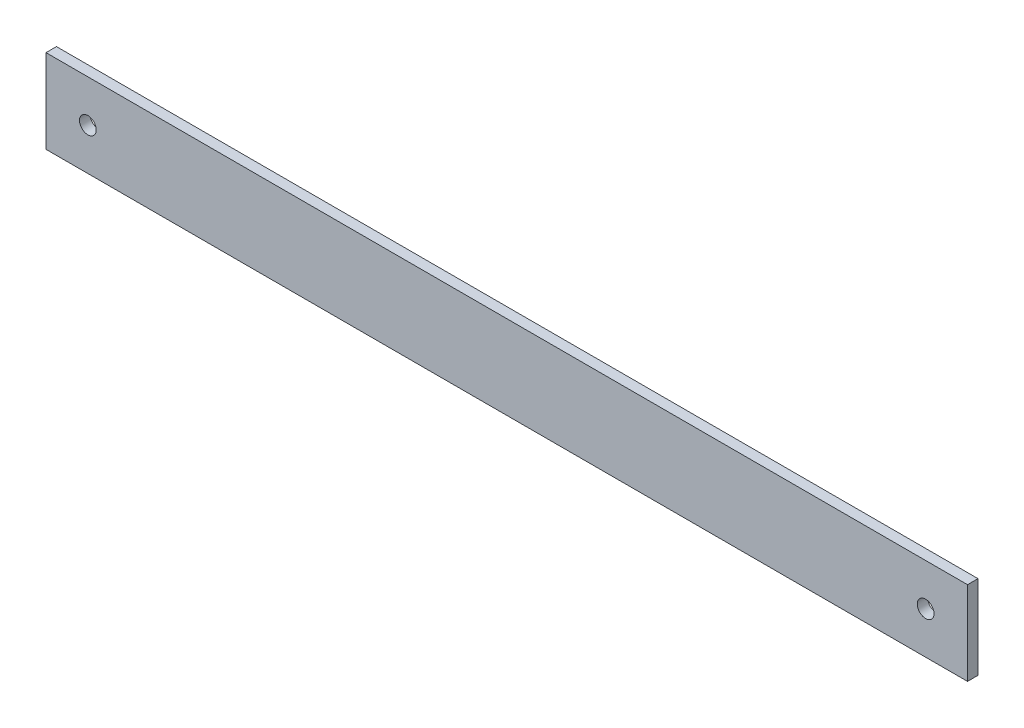
ISO-10303-21;
HEADER;
FILE_DESCRIPTION(('STEP AP214'),'2;1');
FILE_NAME('part.step','',(''),(''),'','','');
FILE_SCHEMA(('AUTOMOTIVE_DESIGN { 1 0 10303 214 1 1 1 1 }'));
ENDSEC;
DATA;
#1=APPLICATION_CONTEXT('core data for automotive mechanical design processes');
#2=APPLICATION_PROTOCOL_DEFINITION('international standard','automotive_design',2000,#1);
#3=PRODUCT_CONTEXT('',#1,'mechanical');
#4=PRODUCT('Part','Part','',(#3));
#5=PRODUCT_RELATED_PRODUCT_CATEGORY('part','',(#4));
#6=PRODUCT_DEFINITION_FORMATION('','',#4);
#7=PRODUCT_DEFINITION_CONTEXT('part definition',#1,'design');
#8=PRODUCT_DEFINITION('design','',#6,#7);
#9=PRODUCT_DEFINITION_SHAPE('','',#8);
#10=(LENGTH_UNIT() NAMED_UNIT(*) SI_UNIT(.MILLI.,.METRE.));
#11=(NAMED_UNIT(*) PLANE_ANGLE_UNIT() SI_UNIT($,.RADIAN.));
#12=(NAMED_UNIT(*) SI_UNIT($,.STERADIAN.) SOLID_ANGLE_UNIT());
#13=UNCERTAINTY_MEASURE_WITH_UNIT(LENGTH_MEASURE(1.E-05),#10,'distance_accuracy_value','');
#14=(GEOMETRIC_REPRESENTATION_CONTEXT(3) GLOBAL_UNCERTAINTY_ASSIGNED_CONTEXT((#13)) GLOBAL_UNIT_ASSIGNED_CONTEXT((#10,
#11,#12)) REPRESENTATION_CONTEXT('',''));
#15=CARTESIAN_POINT('',(0.,0.,0.));
#16=DIRECTION('',(0.,0.,1.));
#17=DIRECTION('',(1.,0.,0.));
#18=AXIS2_PLACEMENT_3D('',#15,#16,#17);
#19=CARTESIAN_POINT('',(0.,0.,5.));
#20=DIRECTION('',(0.,0.,1.));
#21=DIRECTION('',(1.,0.,0.));
#22=AXIS2_PLACEMENT_3D('',#19,#20,#21);
#23=PLANE('',#22);
#24=CARTESIAN_POINT('',(200.,0.,5.));
#25=DIRECTION('',(0.,0.,1.));
#26=DIRECTION('',(1.,0.,0.));
#27=AXIS2_PLACEMENT_3D('',#24,#25,#26);
#28=CIRCLE('',#27,3.99999999999999);
#29=CARTESIAN_POINT('',(204.,0.,5.));
#30=VERTEX_POINT('',#29);
#31=EDGE_CURVE('E100',#30,#30,#28,.T.);
#32=ORIENTED_EDGE('',*,*,#31,.F.);
#33=EDGE_LOOP('',(#32));
#34=FACE_BOUND('',#33,.T.);
#35=DIRECTION('',(0.,1.,0.));
#36=VECTOR('',#35,1.);
#37=CARTESIAN_POINT('',(220.,20.,5.));
#38=LINE('',#37,#36);
#39=CARTESIAN_POINT('',(220.,-20.,5.));
#40=VERTEX_POINT('',#39);
#41=CARTESIAN_POINT('',(220.,20.,5.));
#42=VERTEX_POINT('',#41);
#43=EDGE_CURVE('E85',#40,#42,#38,.T.);
#44=ORIENTED_EDGE('',*,*,#43,.T.);
#45=DIRECTION('',(-1.,0.,0.));
#46=VECTOR('',#45,1.);
#47=CARTESIAN_POINT('',(-220.,20.,5.));
#48=LINE('',#47,#46);
#49=CARTESIAN_POINT('',(-220.,20.,5.));
#50=VERTEX_POINT('',#49);
#51=EDGE_CURVE('E80',#42,#50,#48,.T.);
#52=ORIENTED_EDGE('',*,*,#51,.T.);
#53=DIRECTION('',(0.,-1.,0.));
#54=VECTOR('',#53,1.);
#55=CARTESIAN_POINT('',(-220.,20.,5.));
#56=LINE('',#55,#54);
#57=CARTESIAN_POINT('',(-220.,-20.,5.));
#58=VERTEX_POINT('',#57);
#59=EDGE_CURVE('E83',#50,#58,#56,.T.);
#60=ORIENTED_EDGE('',*,*,#59,.T.);
#61=DIRECTION('',(1.,0.,0.));
#62=VECTOR('',#61,1.);
#63=CARTESIAN_POINT('',(-220.,-20.,5.));
#64=LINE('',#63,#62);
#65=EDGE_CURVE('E50',#58,#40,#64,.T.);
#66=ORIENTED_EDGE('',*,*,#65,.T.);
#67=EDGE_LOOP('',(#44,#52,#60,#66));
#68=FACE_BOUND('',#67,.T.);
#69=CARTESIAN_POINT('',(-200.,0.,5.));
#70=DIRECTION('',(0.,0.,1.));
#71=DIRECTION('',(-1.,0.,0.));
#72=AXIS2_PLACEMENT_3D('',#69,#70,#71);
#73=CIRCLE('',#72,3.99999999999999);
#74=CARTESIAN_POINT('',(-204.,0.,5.));
#75=VERTEX_POINT('',#74);
#76=EDGE_CURVE('E115',#75,#75,#73,.T.);
#77=ORIENTED_EDGE('',*,*,#76,.F.);
#78=EDGE_LOOP('',(#77));
#79=FACE_BOUND('',#78,.T.);
#80=ADVANCED_FACE('F33',(#34,#68,#79),#23,.T.);
#81=CARTESIAN_POINT('',(0.,0.,0.));
#82=DIRECTION('',(0.,0.,1.));
#83=DIRECTION('',(1.,0.,0.));
#84=AXIS2_PLACEMENT_3D('',#81,#82,#83);
#85=PLANE('',#84);
#86=CARTESIAN_POINT('',(200.,0.,0.));
#87=DIRECTION('',(0.,0.,1.));
#88=DIRECTION('',(1.,0.,0.));
#89=AXIS2_PLACEMENT_3D('',#86,#87,#88);
#90=CIRCLE('',#89,3.99999999999999);
#91=CARTESIAN_POINT('',(204.,0.,0.));
#92=VERTEX_POINT('',#91);
#93=EDGE_CURVE('E112',#92,#92,#90,.T.);
#94=ORIENTED_EDGE('',*,*,#93,.T.);
#95=EDGE_LOOP('',(#94));
#96=FACE_BOUND('',#95,.T.);
#97=DIRECTION('',(0.,1.,0.));
#98=VECTOR('',#97,1.);
#99=CARTESIAN_POINT('',(220.,20.,0.));
#100=LINE('',#99,#98);
#101=CARTESIAN_POINT('',(220.,-20.,0.));
#102=VERTEX_POINT('',#101);
#103=CARTESIAN_POINT('',(220.,20.,0.));
#104=VERTEX_POINT('',#103);
#105=EDGE_CURVE('E97',#102,#104,#100,.T.);
#106=ORIENTED_EDGE('',*,*,#105,.F.);
#107=DIRECTION('',(1.,0.,0.));
#108=VECTOR('',#107,1.);
#109=CARTESIAN_POINT('',(-220.,-20.,0.));
#110=LINE('',#109,#108);
#111=CARTESIAN_POINT('',(-220.,-20.,0.));
#112=VERTEX_POINT('',#111);
#113=EDGE_CURVE('E73',#112,#102,#110,.T.);
#114=ORIENTED_EDGE('',*,*,#113,.F.);
#115=DIRECTION('',(0.,-1.,0.));
#116=VECTOR('',#115,1.);
#117=CARTESIAN_POINT('',(-220.,20.,0.));
#118=LINE('',#117,#116);
#119=CARTESIAN_POINT('',(-220.,20.,0.));
#120=VERTEX_POINT('',#119);
#121=EDGE_CURVE('E67',#120,#112,#118,.T.);
#122=ORIENTED_EDGE('',*,*,#121,.F.);
#123=DIRECTION('',(-1.,0.,0.));
#124=VECTOR('',#123,1.);
#125=CARTESIAN_POINT('',(-220.,20.,0.));
#126=LINE('',#125,#124);
#127=EDGE_CURVE('E89',#104,#120,#126,.T.);
#128=ORIENTED_EDGE('',*,*,#127,.F.);
#129=EDGE_LOOP('',(#106,#114,#122,#128));
#130=FACE_BOUND('',#129,.T.);
#131=CARTESIAN_POINT('',(-200.,0.,0.));
#132=DIRECTION('',(0.,0.,1.));
#133=DIRECTION('',(-1.,0.,0.));
#134=AXIS2_PLACEMENT_3D('',#131,#132,#133);
#135=CIRCLE('',#134,3.99999999999999);
#136=CARTESIAN_POINT('',(-204.,0.,0.));
#137=VERTEX_POINT('',#136);
#138=EDGE_CURVE('E118',#137,#137,#135,.T.);
#139=ORIENTED_EDGE('',*,*,#138,.T.);
#140=EDGE_LOOP('',(#139));
#141=FACE_BOUND('',#140,.T.);
#142=ADVANCED_FACE('F108',(#96,#130,#141),#85,.F.);
#143=CARTESIAN_POINT('',(220.,20.,5.));
#144=DIRECTION('',(-1.,0.,0.));
#145=DIRECTION('',(0.,-1.,0.));
#146=AXIS2_PLACEMENT_3D('',#143,#144,#145);
#147=PLANE('',#146);
#148=ORIENTED_EDGE('',*,*,#105,.T.);
#149=DIRECTION('',(0.,0.,-1.));
#150=VECTOR('',#149,1.);
#151=CARTESIAN_POINT('',(220.,20.,5.));
#152=LINE('',#151,#150);
#153=EDGE_CURVE('E11',#42,#104,#152,.T.);
#154=ORIENTED_EDGE('',*,*,#153,.F.);
#155=ORIENTED_EDGE('',*,*,#43,.F.);
#156=DIRECTION('',(0.,0.,-1.));
#157=VECTOR('',#156,1.);
#158=CARTESIAN_POINT('',(220.,-20.,5.));
#159=LINE('',#158,#157);
#160=EDGE_CURVE('E93',#40,#102,#159,.T.);
#161=ORIENTED_EDGE('',*,*,#160,.T.);
#162=EDGE_LOOP('',(#148,#154,#155,#161));
#163=FACE_BOUND('',#162,.T.);
#164=ADVANCED_FACE('F35',(#163),#147,.F.);
#165=CARTESIAN_POINT('',(-220.,20.,5.));
#166=DIRECTION('',(0.,-1.,0.));
#167=DIRECTION('',(1.,0.,0.));
#168=AXIS2_PLACEMENT_3D('',#165,#166,#167);
#169=PLANE('',#168);
#170=ORIENTED_EDGE('',*,*,#127,.T.);
#171=DIRECTION('',(0.,0.,-1.));
#172=VECTOR('',#171,1.);
#173=CARTESIAN_POINT('',(-220.,20.,5.));
#174=LINE('',#173,#172);
#175=EDGE_CURVE('E42',#50,#120,#174,.T.);
#176=ORIENTED_EDGE('',*,*,#175,.F.);
#177=ORIENTED_EDGE('',*,*,#51,.F.);
#178=ORIENTED_EDGE('',*,*,#153,.T.);
#179=EDGE_LOOP('',(#170,#176,#177,#178));
#180=FACE_BOUND('',#179,.T.);
#181=ADVANCED_FACE('F88',(#180),#169,.F.);
#182=CARTESIAN_POINT('',(-220.,20.,5.));
#183=DIRECTION('',(1.,0.,0.));
#184=DIRECTION('',(0.,1.,0.));
#185=AXIS2_PLACEMENT_3D('',#182,#183,#184);
#186=PLANE('',#185);
#187=ORIENTED_EDGE('',*,*,#121,.T.);
#188=DIRECTION('',(0.,0.,-1.));
#189=VECTOR('',#188,1.);
#190=CARTESIAN_POINT('',(-220.,-20.,5.));
#191=LINE('',#190,#189);
#192=EDGE_CURVE('E90',#58,#112,#191,.T.);
#193=ORIENTED_EDGE('',*,*,#192,.F.);
#194=ORIENTED_EDGE('',*,*,#59,.F.);
#195=ORIENTED_EDGE('',*,*,#175,.T.);
#196=EDGE_LOOP('',(#187,#193,#194,#195));
#197=FACE_BOUND('',#196,.T.);
#198=ADVANCED_FACE('F91',(#197),#186,.F.);
#199=CARTESIAN_POINT('',(-220.,-20.,5.));
#200=DIRECTION('',(0.,1.,0.));
#201=DIRECTION('',(0.,0.,1.));
#202=AXIS2_PLACEMENT_3D('',#199,#200,#201);
#203=PLANE('',#202);
#204=ORIENTED_EDGE('',*,*,#113,.T.);
#205=ORIENTED_EDGE('',*,*,#160,.F.);
#206=ORIENTED_EDGE('',*,*,#65,.F.);
#207=ORIENTED_EDGE('',*,*,#192,.T.);
#208=EDGE_LOOP('',(#204,#205,#206,#207));
#209=FACE_BOUND('',#208,.T.);
#210=ADVANCED_FACE('F105',(#209),#203,.F.);
#211=CARTESIAN_POINT('',(200.,0.,5.));
#212=DIRECTION('',(0.,0.,-1.));
#213=DIRECTION('',(-1.,0.,0.));
#214=AXIS2_PLACEMENT_3D('',#211,#212,#213);
#215=CYLINDRICAL_SURFACE('',#214,3.99999999999999);
#216=ORIENTED_EDGE('',*,*,#31,.T.);
#217=EDGE_LOOP('',(#216));
#218=FACE_BOUND('',#217,.T.);
#219=ORIENTED_EDGE('',*,*,#93,.F.);
#220=EDGE_LOOP('',(#219));
#221=FACE_BOUND('',#220,.T.);
#222=ADVANCED_FACE('F136',(#218,#221),#215,.F.);
#223=CARTESIAN_POINT('',(-200.,0.,5.));
#224=DIRECTION('',(0.,0.,-1.));
#225=DIRECTION('',(-1.,0.,0.));
#226=AXIS2_PLACEMENT_3D('',#223,#224,#225);
#227=CYLINDRICAL_SURFACE('',#226,3.99999999999999);
#228=ORIENTED_EDGE('',*,*,#76,.T.);
#229=EDGE_LOOP('',(#228));
#230=FACE_BOUND('',#229,.T.);
#231=ORIENTED_EDGE('',*,*,#138,.F.);
#232=EDGE_LOOP('',(#231));
#233=FACE_BOUND('',#232,.T.);
#234=ADVANCED_FACE('F124',(#230,#233),#227,.F.);
#235=CLOSED_SHELL('',(#80,#142,#164,#181,#198,#210,#222,#234));
#236=MANIFOLD_SOLID_BREP('B2',#235);
#237=ADVANCED_BREP_SHAPE_REPRESENTATION('',(#18,#236),#14);
#238=SHAPE_DEFINITION_REPRESENTATION(#9,#237);
ENDSEC;
END-ISO-10303-21;
